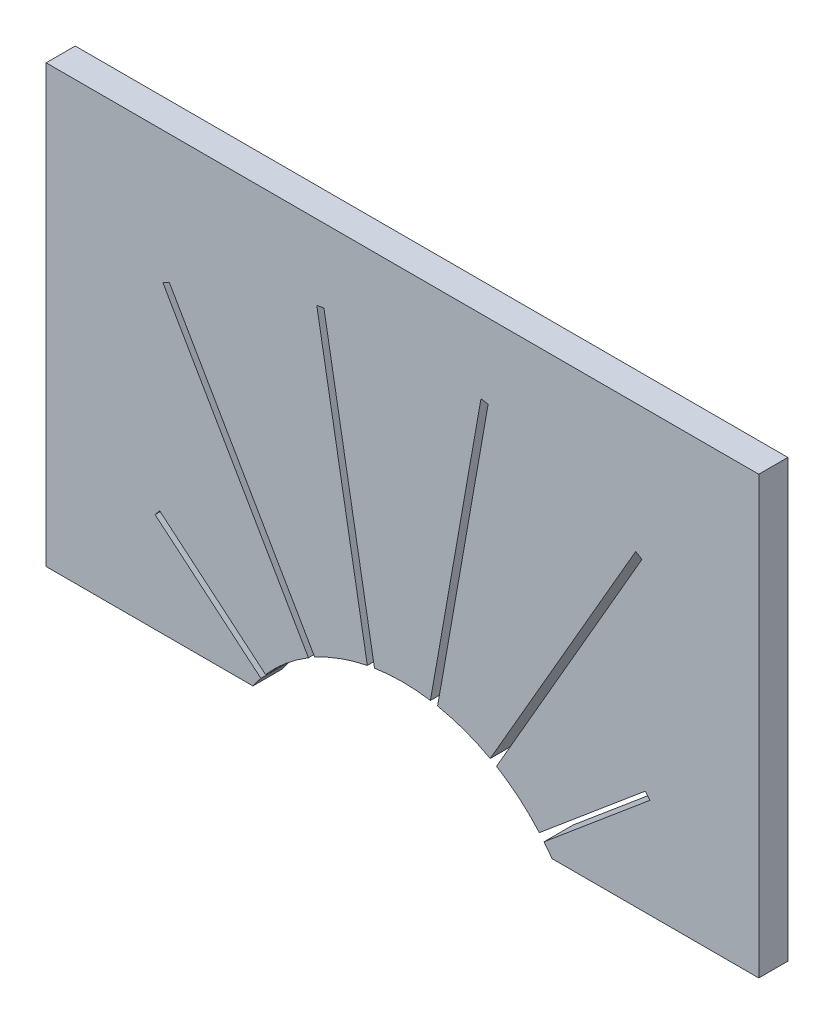
ISO-10303-21;
HEADER;
FILE_DESCRIPTION(('STEP AP214'),'2;1');
FILE_NAME('part.step','',(''),(''),'','','');
FILE_SCHEMA(('AUTOMOTIVE_DESIGN { 1 0 10303 214 1 1 1 1 }'));
ENDSEC;
DATA;
#1=APPLICATION_CONTEXT('core data for automotive mechanical design processes');
#2=APPLICATION_PROTOCOL_DEFINITION('international standard','automotive_design',2000,#1);
#3=PRODUCT_CONTEXT('',#1,'mechanical');
#4=PRODUCT('Part','Part','',(#3));
#5=PRODUCT_RELATED_PRODUCT_CATEGORY('part','',(#4));
#6=PRODUCT_DEFINITION_FORMATION('','',#4);
#7=PRODUCT_DEFINITION_CONTEXT('part definition',#1,'design');
#8=PRODUCT_DEFINITION('design','',#6,#7);
#9=PRODUCT_DEFINITION_SHAPE('','',#8);
#10=(LENGTH_UNIT() NAMED_UNIT(*) SI_UNIT(.MILLI.,.METRE.));
#11=(NAMED_UNIT(*) PLANE_ANGLE_UNIT() SI_UNIT($,.RADIAN.));
#12=(NAMED_UNIT(*) SI_UNIT($,.STERADIAN.) SOLID_ANGLE_UNIT());
#13=UNCERTAINTY_MEASURE_WITH_UNIT(LENGTH_MEASURE(1.E-05),#10,'distance_accuracy_value','');
#14=(GEOMETRIC_REPRESENTATION_CONTEXT(3) GLOBAL_UNCERTAINTY_ASSIGNED_CONTEXT((#13)) GLOBAL_UNIT_ASSIGNED_CONTEXT((#10,
#11,#12)) REPRESENTATION_CONTEXT('',''));
#15=CARTESIAN_POINT('',(0.,0.,0.));
#16=DIRECTION('',(0.,0.,1.));
#17=DIRECTION('',(1.,0.,0.));
#18=AXIS2_PLACEMENT_3D('',#15,#16,#17);
#19=CARTESIAN_POINT('',(-24.5,-15.,1.));
#20=DIRECTION('',(0.,1.,0.));
#21=DIRECTION('',(0.,0.,1.));
#22=AXIS2_PLACEMENT_3D('',#19,#20,#21);
#23=PLANE('',#22);
#24=DIRECTION('',(1.,0.,0.));
#25=VECTOR('',#24,1.);
#26=CARTESIAN_POINT('',(-24.5,-15.,-1.));
#27=LINE('',#26,#25);
#28=CARTESIAN_POINT('',(-24.5,-15.,-1.));
#29=VERTEX_POINT('',#28);
#30=CARTESIAN_POINT('',(-10.27956497134,-15.,-1.));
#31=VERTEX_POINT('',#30);
#32=EDGE_CURVE('E255',#29,#31,#27,.T.);
#33=ORIENTED_EDGE('',*,*,#32,.T.);
#34=DIRECTION('',(0.,0.,1.));
#35=VECTOR('',#34,1.);
#36=CARTESIAN_POINT('',(-10.27956497134,-15.,-9.));
#37=LINE('',#36,#35);
#38=CARTESIAN_POINT('',(-10.27956497134,-15.,1.));
#39=VERTEX_POINT('',#38);
#40=EDGE_CURVE('E240',#31,#39,#37,.T.);
#41=ORIENTED_EDGE('',*,*,#40,.T.);
#42=DIRECTION('',(1.,0.,0.));
#43=VECTOR('',#42,1.);
#44=CARTESIAN_POINT('',(-24.5,-15.,1.));
#45=LINE('',#44,#43);
#46=CARTESIAN_POINT('',(-24.5,-15.,1.));
#47=VERTEX_POINT('',#46);
#48=EDGE_CURVE('E253',#47,#39,#45,.T.);
#49=ORIENTED_EDGE('',*,*,#48,.F.);
#50=DIRECTION('',(0.,0.,-1.));
#51=VECTOR('',#50,1.);
#52=CARTESIAN_POINT('',(-24.5,-15.,1.));
#53=LINE('',#52,#51);
#54=EDGE_CURVE('E265',#47,#29,#53,.T.);
#55=ORIENTED_EDGE('',*,*,#54,.T.);
#56=EDGE_LOOP('',(#33,#41,#49,#55));
#57=FACE_BOUND('',#56,.T.);
#58=ADVANCED_FACE('F31',(#57),#23,.F.);
#59=CARTESIAN_POINT('',(24.5,-15.,1.));
#60=DIRECTION('',(-1.,0.,0.));
#61=DIRECTION('',(0.,0.,1.));
#62=AXIS2_PLACEMENT_3D('',#59,#60,#61);
#63=PLANE('',#62);
#64=DIRECTION('',(0.,1.,0.));
#65=VECTOR('',#64,1.);
#66=CARTESIAN_POINT('',(24.5,-15.,-1.));
#67=LINE('',#66,#65);
#68=CARTESIAN_POINT('',(24.5,-15.,-1.));
#69=VERTEX_POINT('',#68);
#70=CARTESIAN_POINT('',(24.5,15.,-1.));
#71=VERTEX_POINT('',#70);
#72=EDGE_CURVE('E270',#69,#71,#67,.T.);
#73=ORIENTED_EDGE('',*,*,#72,.T.);
#74=DIRECTION('',(0.,0.,-1.));
#75=VECTOR('',#74,1.);
#76=CARTESIAN_POINT('',(24.5,15.,1.));
#77=LINE('',#76,#75);
#78=CARTESIAN_POINT('',(24.5,15.,1.));
#79=VERTEX_POINT('',#78);
#80=EDGE_CURVE('E283',#79,#71,#77,.T.);
#81=ORIENTED_EDGE('',*,*,#80,.F.);
#82=DIRECTION('',(0.,1.,0.));
#83=VECTOR('',#82,1.);
#84=CARTESIAN_POINT('',(24.5,-15.,1.));
#85=LINE('',#84,#83);
#86=CARTESIAN_POINT('',(24.5,-15.,1.));
#87=VERTEX_POINT('',#86);
#88=EDGE_CURVE('E277',#87,#79,#85,.T.);
#89=ORIENTED_EDGE('',*,*,#88,.F.);
#90=DIRECTION('',(0.,0.,-1.));
#91=VECTOR('',#90,1.);
#92=CARTESIAN_POINT('',(24.5,-15.,1.));
#93=LINE('',#92,#91);
#94=EDGE_CURVE('E263',#87,#69,#93,.T.);
#95=ORIENTED_EDGE('',*,*,#94,.T.);
#96=EDGE_LOOP('',(#73,#81,#89,#95));
#97=FACE_BOUND('',#96,.T.);
#98=ADVANCED_FACE('F33',(#97),#63,.F.);
#99=CARTESIAN_POINT('',(-24.5,15.,1.));
#100=DIRECTION('',(0.,-1.,0.));
#101=DIRECTION('',(0.,0.,-1.));
#102=AXIS2_PLACEMENT_3D('',#99,#100,#101);
#103=PLANE('',#102);
#104=DIRECTION('',(-1.,0.,0.));
#105=VECTOR('',#104,1.);
#106=CARTESIAN_POINT('',(-24.5,15.,-1.));
#107=LINE('',#106,#105);
#108=CARTESIAN_POINT('',(-24.5,15.,-1.));
#109=VERTEX_POINT('',#108);
#110=EDGE_CURVE('E273',#71,#109,#107,.T.);
#111=ORIENTED_EDGE('',*,*,#110,.T.);
#112=DIRECTION('',(0.,0.,-1.));
#113=VECTOR('',#112,1.);
#114=CARTESIAN_POINT('',(-24.5,15.,1.));
#115=LINE('',#114,#113);
#116=CARTESIAN_POINT('',(-24.5,15.,1.));
#117=VERTEX_POINT('',#116);
#118=EDGE_CURVE('E280',#117,#109,#115,.T.);
#119=ORIENTED_EDGE('',*,*,#118,.F.);
#120=DIRECTION('',(-1.,0.,0.));
#121=VECTOR('',#120,1.);
#122=CARTESIAN_POINT('',(-24.5,15.,1.));
#123=LINE('',#122,#121);
#124=EDGE_CURVE('E85',#79,#117,#123,.T.);
#125=ORIENTED_EDGE('',*,*,#124,.F.);
#126=ORIENTED_EDGE('',*,*,#80,.T.);
#127=EDGE_LOOP('',(#111,#119,#125,#126));
#128=FACE_BOUND('',#127,.T.);
#129=ADVANCED_FACE('F406',(#128),#103,.F.);
#130=CARTESIAN_POINT('',(-24.5,-15.,1.));
#131=DIRECTION('',(1.,0.,0.));
#132=DIRECTION('',(0.,0.,-1.));
#133=AXIS2_PLACEMENT_3D('',#130,#131,#132);
#134=PLANE('',#133);
#135=DIRECTION('',(0.,-1.,0.));
#136=VECTOR('',#135,1.);
#137=CARTESIAN_POINT('',(-24.5,-15.,-1.));
#138=LINE('',#137,#136);
#139=EDGE_CURVE('E275',#109,#29,#138,.T.);
#140=ORIENTED_EDGE('',*,*,#139,.T.);
#141=ORIENTED_EDGE('',*,*,#54,.F.);
#142=DIRECTION('',(0.,-1.,0.));
#143=VECTOR('',#142,1.);
#144=CARTESIAN_POINT('',(-24.5,-15.,1.));
#145=LINE('',#144,#143);
#146=EDGE_CURVE('E261',#117,#47,#145,.T.);
#147=ORIENTED_EDGE('',*,*,#146,.F.);
#148=ORIENTED_EDGE('',*,*,#118,.T.);
#149=EDGE_LOOP('',(#140,#141,#147,#148));
#150=FACE_BOUND('',#149,.T.);
#151=ADVANCED_FACE('F409',(#150),#134,.F.);
#152=CARTESIAN_POINT('',(10.27956497134,-15.,1.));
#153=VERTEX_POINT('',#152);
#154=EDGE_CURVE('E55',#153,#87,#45,.T.);
#155=ORIENTED_EDGE('',*,*,#154,.F.);
#156=DIRECTION('',(0.,0.,1.));
#157=VECTOR('',#156,1.);
#158=CARTESIAN_POINT('',(10.27956497134,-15.,-9.));
#159=LINE('',#158,#157);
#160=CARTESIAN_POINT('',(10.27956497134,-15.,-1.));
#161=VERTEX_POINT('',#160);
#162=EDGE_CURVE('E256',#161,#153,#159,.T.);
#163=ORIENTED_EDGE('',*,*,#162,.F.);
#164=EDGE_CURVE('E77',#161,#69,#27,.T.);
#165=ORIENTED_EDGE('',*,*,#164,.T.);
#166=ORIENTED_EDGE('',*,*,#94,.F.);
#167=EDGE_LOOP('',(#155,#163,#165,#166));
#168=FACE_BOUND('',#167,.T.);
#169=ADVANCED_FACE('F412',(#168),#23,.F.);
#170=CARTESIAN_POINT('',(24.5,15.,1.));
#171=DIRECTION('',(0.,0.,-1.));
#172=DIRECTION('',(-1.,0.,0.));
#173=AXIS2_PLACEMENT_3D('',#170,#171,#172);
#174=PLANE('',#173);
#175=ORIENTED_EDGE('',*,*,#48,.T.);
#176=CARTESIAN_POINT('',(0.,-22.112,1.));
#177=DIRECTION('',(0.,0.,1.));
#178=DIRECTION('',(1.,0.,0.));
#179=AXIS2_PLACEMENT_3D('',#176,#177,#178);
#180=CIRCLE('',#179,12.5);
#181=CARTESIAN_POINT('',(-9.73433713875166,-14.2702731194513,1.));
#182=VERTEX_POINT('',#181);
#183=EDGE_CURVE('E237',#182,#39,#180,.T.);
#184=ORIENTED_EDGE('',*,*,#183,.F.);
#185=DIRECTION('',(0.766044443118979,-0.642787609686538,0.));
#186=VECTOR('',#185,1.);
#187=CARTESIAN_POINT('',(-9.73433713875166,-14.2702731194513,1.));
#188=LINE('',#187,#186);
#189=CARTESIAN_POINT('',(-17.0136746510392,-8.16218369767592,1.));
#190=VERTEX_POINT('',#189);
#191=EDGE_CURVE('E257',#190,#182,#188,.T.);
#192=ORIENTED_EDGE('',*,*,#191,.F.);
#193=DIRECTION('',(-0.642787609686541,-0.766044443118977,0.));
#194=VECTOR('',#193,1.);
#195=CARTESIAN_POINT('',(-17.0136746510392,-8.16218369767592,1.));
#196=LINE('',#195,#194);
#197=CARTESIAN_POINT('',(-16.6922808461959,-7.77916147611643,1.));
#198=VERTEX_POINT('',#197);
#199=EDGE_CURVE('E342',#198,#190,#196,.T.);
#200=ORIENTED_EDGE('',*,*,#199,.F.);
#201=DIRECTION('',(-0.76604444311898,0.642787609686538,0.));
#202=VECTOR('',#201,1.);
#203=CARTESIAN_POINT('',(-9.41294333390839,-13.8872508978918,1.));
#204=LINE('',#203,#202);
#205=CARTESIAN_POINT('',(-9.41294333390839,-13.8872508978918,1.));
#206=VERTEX_POINT('',#205);
#207=EDGE_CURVE('E775',#206,#198,#204,.T.);
#208=ORIENTED_EDGE('',*,*,#207,.F.);
#209=CARTESIAN_POINT('',(0.,-22.112,1.));
#210=DIRECTION('',(0.,0.,1.));
#211=DIRECTION('',(1.,0.,0.));
#212=AXIS2_PLACEMENT_3D('',#209,#210,#211);
#213=CIRCLE('',#212,12.5);
#214=CARTESIAN_POINT('',(-6.46525622592112,-11.4138477327537,1.));
#215=VERTEX_POINT('',#214);
#216=EDGE_CURVE('E359',#215,#206,#213,.T.);
#217=ORIENTED_EDGE('',*,*,#216,.F.);
#218=DIRECTION('',(0.500000000000001,-0.866025403784438,0.));
#219=VECTOR('',#218,1.);
#220=CARTESIAN_POINT('',(-6.46525622592112,-11.4138477327537,1.));
#221=LINE('',#220,#219);
#222=CARTESIAN_POINT('',(-16.4710257224933,5.91665340413209,1.));
#223=VERTEX_POINT('',#222);
#224=EDGE_CURVE('E771',#223,#215,#221,.T.);
#225=ORIENTED_EDGE('',*,*,#224,.F.);
#226=CARTESIAN_POINT('',(0.,-22.112,1.));
#227=DIRECTION('',(0.,0.,1.));
#228=DIRECTION('',(1.,0.,0.));
#229=AXIS2_PLACEMENT_3D('',#226,#227,#228);
#230=CIRCLE('',#229,32.51);
#231=CARTESIAN_POINT('',(-16.038013020601,6.16665340413209,1.));
#232=VERTEX_POINT('',#231);
#233=EDGE_CURVE('E768',#232,#223,#230,.T.);
#234=ORIENTED_EDGE('',*,*,#233,.F.);
#235=DIRECTION('',(-0.500000000000001,0.866025403784438,0.));
#236=VECTOR('',#235,1.);
#237=CARTESIAN_POINT('',(-6.0322435240289,-11.1638477327537,1.));
#238=LINE('',#237,#236);
#239=CARTESIAN_POINT('',(-6.0322435240289,-11.1638477327537,1.));
#240=VERTEX_POINT('',#239);
#241=EDGE_CURVE('E765',#240,#232,#238,.T.);
#242=ORIENTED_EDGE('',*,*,#241,.F.);
#243=CARTESIAN_POINT('',(0.,-22.112,1.));
#244=DIRECTION('',(0.,0.,1.));
#245=DIRECTION('',(1.,0.,0.));
#246=AXIS2_PLACEMENT_3D('',#243,#244,#245);
#247=CIRCLE('',#246,12.5);
#248=CARTESIAN_POINT('',(-2.4163699952248,-9.84777739739785,1.));
#249=VERTEX_POINT('',#248);
#250=EDGE_CURVE('E762',#249,#240,#247,.T.);
#251=ORIENTED_EDGE('',*,*,#250,.F.);
#252=DIRECTION('',(0.173648177666931,-0.984807753012208,0.));
#253=VECTOR('',#252,1.);
#254=CARTESIAN_POINT('',(-2.4163699952248,-9.84777739739786,1.));
#255=LINE('',#254,#253);
#256=CARTESIAN_POINT('',(-5.89133727369503,9.85974135275668,1.));
#257=VERTEX_POINT('',#256);
#258=EDGE_CURVE('E759',#257,#249,#255,.T.);
#259=ORIENTED_EDGE('',*,*,#258,.F.);
#260=CARTESIAN_POINT('',(0.,-22.112,1.));
#261=DIRECTION('',(0.,0.,1.));
#262=DIRECTION('',(1.,0.,0.));
#263=AXIS2_PLACEMENT_3D('',#260,#261,#262);
#264=CIRCLE('',#263,32.51);
#265=CARTESIAN_POINT('',(-5.39893339718892,9.94656544159014,1.));
#266=VERTEX_POINT('',#265);
#267=EDGE_CURVE('E756',#266,#257,#264,.T.);
#268=ORIENTED_EDGE('',*,*,#267,.F.);
#269=DIRECTION('',(-0.173648177666931,0.984807753012208,0.));
#270=VECTOR('',#269,1.);
#271=CARTESIAN_POINT('',(-1.92396611871869,-9.76095330856439,1.));
#272=LINE('',#271,#270);
#273=CARTESIAN_POINT('',(-1.92396611871869,-9.76095330856439,1.));
#274=VERTEX_POINT('',#273);
#275=EDGE_CURVE('E753',#274,#266,#272,.T.);
#276=ORIENTED_EDGE('',*,*,#275,.F.);
#277=CARTESIAN_POINT('',(0.,-22.112,1.));
#278=DIRECTION('',(0.,0.,1.));
#279=DIRECTION('',(1.,0.,0.));
#280=AXIS2_PLACEMENT_3D('',#277,#278,#279);
#281=CIRCLE('',#280,12.5);
#282=CARTESIAN_POINT('',(1.92396611871869,-9.76095330856439,1.));
#283=VERTEX_POINT('',#282);
#284=EDGE_CURVE('E750',#283,#274,#281,.T.);
#285=ORIENTED_EDGE('',*,*,#284,.F.);
#286=DIRECTION('',(-0.173648177666931,-0.984807753012208,0.));
#287=VECTOR('',#286,1.);
#288=CARTESIAN_POINT('',(1.92396611871869,-9.76095330856439,1.));
#289=LINE('',#288,#287);
#290=CARTESIAN_POINT('',(5.39893339718892,9.94656544159015,1.));
#291=VERTEX_POINT('',#290);
#292=EDGE_CURVE('E747',#291,#283,#289,.T.);
#293=ORIENTED_EDGE('',*,*,#292,.F.);
#294=CARTESIAN_POINT('',(0.,-22.112,1.));
#295=DIRECTION('',(0.,0.,1.));
#296=DIRECTION('',(1.,0.,0.));
#297=AXIS2_PLACEMENT_3D('',#294,#295,#296);
#298=CIRCLE('',#297,32.51);
#299=CARTESIAN_POINT('',(5.89133727369502,9.85974135275668,1.));
#300=VERTEX_POINT('',#299);
#301=EDGE_CURVE('E744',#300,#291,#298,.T.);
#302=ORIENTED_EDGE('',*,*,#301,.F.);
#303=DIRECTION('',(0.173648177666931,0.984807753012208,0.));
#304=VECTOR('',#303,1.);
#305=CARTESIAN_POINT('',(2.4163699952248,-9.84777739739786,1.));
#306=LINE('',#305,#304);
#307=CARTESIAN_POINT('',(2.4163699952248,-9.84777739739786,1.));
#308=VERTEX_POINT('',#307);
#309=EDGE_CURVE('E741',#308,#300,#306,.T.);
#310=ORIENTED_EDGE('',*,*,#309,.F.);
#311=CARTESIAN_POINT('',(0.,-22.112,1.));
#312=DIRECTION('',(0.,0.,1.));
#313=DIRECTION('',(1.,0.,0.));
#314=AXIS2_PLACEMENT_3D('',#311,#312,#313);
#315=CIRCLE('',#314,12.5);
#316=CARTESIAN_POINT('',(6.0322435240289,-11.1638477327537,1.));
#317=VERTEX_POINT('',#316);
#318=EDGE_CURVE('E738',#317,#308,#315,.T.);
#319=ORIENTED_EDGE('',*,*,#318,.F.);
#320=DIRECTION('',(-0.500000000000001,-0.866025403784438,0.));
#321=VECTOR('',#320,1.);
#322=CARTESIAN_POINT('',(6.0322435240289,-11.1638477327537,1.));
#323=LINE('',#322,#321);
#324=CARTESIAN_POINT('',(16.038013020601,6.16665340413209,1.));
#325=VERTEX_POINT('',#324);
#326=EDGE_CURVE('E735',#325,#317,#323,.T.);
#327=ORIENTED_EDGE('',*,*,#326,.F.);
#328=CARTESIAN_POINT('',(0.,-22.112,1.));
#329=DIRECTION('',(0.,0.,1.));
#330=DIRECTION('',(1.,0.,0.));
#331=AXIS2_PLACEMENT_3D('',#328,#329,#330);
#332=CIRCLE('',#331,32.51);
#333=CARTESIAN_POINT('',(16.4710257224933,5.91665340413209,1.));
#334=VERTEX_POINT('',#333);
#335=EDGE_CURVE('E732',#334,#325,#332,.T.);
#336=ORIENTED_EDGE('',*,*,#335,.F.);
#337=DIRECTION('',(0.500000000000001,0.866025403784438,0.));
#338=VECTOR('',#337,1.);
#339=CARTESIAN_POINT('',(6.46525622592112,-11.4138477327537,1.));
#340=LINE('',#339,#338);
#341=CARTESIAN_POINT('',(6.46525622592112,-11.4138477327537,1.));
#342=VERTEX_POINT('',#341);
#343=EDGE_CURVE('E729',#342,#334,#340,.T.);
#344=ORIENTED_EDGE('',*,*,#343,.F.);
#345=CARTESIAN_POINT('',(0.,-22.112,1.));
#346=DIRECTION('',(0.,0.,1.));
#347=DIRECTION('',(1.,0.,0.));
#348=AXIS2_PLACEMENT_3D('',#345,#346,#347);
#349=CIRCLE('',#348,12.5);
#350=CARTESIAN_POINT('',(9.41294333390839,-13.8872508978918,1.));
#351=VERTEX_POINT('',#350);
#352=EDGE_CURVE('E723',#351,#342,#349,.T.);
#353=ORIENTED_EDGE('',*,*,#352,.F.);
#354=DIRECTION('',(-0.766044443118979,-0.642787609686538,0.));
#355=VECTOR('',#354,1.);
#356=CARTESIAN_POINT('',(9.41294333390839,-13.8872508978918,1.));
#357=LINE('',#356,#355);
#358=CARTESIAN_POINT('',(16.6922808461959,-7.77916147611643,1.));
#359=VERTEX_POINT('',#358);
#360=EDGE_CURVE('E721',#359,#351,#357,.T.);
#361=ORIENTED_EDGE('',*,*,#360,.F.);
#362=DIRECTION('',(-0.642787609686538,0.766044443118979,0.));
#363=VECTOR('',#362,1.);
#364=CARTESIAN_POINT('',(17.0136746510392,-8.16218369767592,1.));
#365=LINE('',#364,#363);
#366=CARTESIAN_POINT('',(17.0136746510392,-8.16218369767592,1.));
#367=VERTEX_POINT('',#366);
#368=EDGE_CURVE('E716',#367,#359,#365,.T.);
#369=ORIENTED_EDGE('',*,*,#368,.F.);
#370=DIRECTION('',(0.766044443118979,0.642787609686538,0.));
#371=VECTOR('',#370,1.);
#372=CARTESIAN_POINT('',(9.73433713875166,-14.2702731194513,1.));
#373=LINE('',#372,#371);
#374=CARTESIAN_POINT('',(9.73433713875166,-14.2702731194513,1.));
#375=VERTEX_POINT('',#374);
#376=EDGE_CURVE('E714',#375,#367,#373,.T.);
#377=ORIENTED_EDGE('',*,*,#376,.F.);
#378=CARTESIAN_POINT('',(0.,-22.112,1.));
#379=DIRECTION('',(0.,0.,1.));
#380=DIRECTION('',(1.,0.,0.));
#381=AXIS2_PLACEMENT_3D('',#378,#379,#380);
#382=CIRCLE('',#381,12.5);
#383=EDGE_CURVE('E247',#153,#375,#382,.T.);
#384=ORIENTED_EDGE('',*,*,#383,.F.);
#385=ORIENTED_EDGE('',*,*,#154,.T.);
#386=ORIENTED_EDGE('',*,*,#88,.T.);
#387=ORIENTED_EDGE('',*,*,#124,.T.);
#388=ORIENTED_EDGE('',*,*,#146,.T.);
#389=EDGE_LOOP('',(#175,#184,#192,#200,#208,#217,#225,#234,#242,#251,#259,#268,#276,#285,#293,
#302,#310,#319,#327,#336,#344,#353,#361,#369,#377,#384,#385,#386,#387,#388));
#390=FACE_BOUND('',#389,.T.);
#391=ADVANCED_FACE('F259',(#390),#174,.F.);
#392=CARTESIAN_POINT('',(24.5,15.,-1.));
#393=DIRECTION('',(0.,0.,-1.));
#394=DIRECTION('',(-1.,0.,0.));
#395=AXIS2_PLACEMENT_3D('',#392,#393,#394);
#396=PLANE('',#395);
#397=CARTESIAN_POINT('',(0.,-22.112,-1.));
#398=DIRECTION('',(0.,0.,-1.));
#399=DIRECTION('',(-1.,0.,0.));
#400=AXIS2_PLACEMENT_3D('',#397,#398,#399);
#401=CIRCLE('',#400,12.5);
#402=CARTESIAN_POINT('',(-9.73433713875166,-14.2702731194513,-1.));
#403=VERTEX_POINT('',#402);
#404=EDGE_CURVE('E11',#31,#403,#401,.T.);
#405=ORIENTED_EDGE('',*,*,#404,.F.);
#406=ORIENTED_EDGE('',*,*,#32,.F.);
#407=ORIENTED_EDGE('',*,*,#139,.F.);
#408=ORIENTED_EDGE('',*,*,#110,.F.);
#409=ORIENTED_EDGE('',*,*,#72,.F.);
#410=ORIENTED_EDGE('',*,*,#164,.F.);
#411=CARTESIAN_POINT('',(0.,-22.112,-1.));
#412=DIRECTION('',(0.,0.,-1.));
#413=DIRECTION('',(-1.,0.,0.));
#414=AXIS2_PLACEMENT_3D('',#411,#412,#413);
#415=CIRCLE('',#414,12.5);
#416=CARTESIAN_POINT('',(9.73433713875166,-14.2702731194513,-1.));
#417=VERTEX_POINT('',#416);
#418=EDGE_CURVE('E285',#417,#161,#415,.T.);
#419=ORIENTED_EDGE('',*,*,#418,.F.);
#420=DIRECTION('',(-0.766044443118979,-0.642787609686538,0.));
#421=VECTOR('',#420,1.);
#422=CARTESIAN_POINT('',(32.8119797437361,5.09416827883215,-1.));
#423=LINE('',#422,#421);
#424=CARTESIAN_POINT('',(17.0136746510392,-8.16218369767592,-1.));
#425=VERTEX_POINT('',#424);
#426=EDGE_CURVE('E287',#425,#417,#423,.T.);
#427=ORIENTED_EDGE('',*,*,#426,.F.);
#428=DIRECTION('',(0.642787609686538,-0.766044443118979,0.));
#429=VECTOR('',#428,1.);
#430=CARTESIAN_POINT('',(8.70169490730308,1.7436480234919,-1.));
#431=LINE('',#430,#429);
#432=CARTESIAN_POINT('',(16.6922808461959,-7.77916147611643,-1.));
#433=VERTEX_POINT('',#432);
#434=EDGE_CURVE('E289',#433,#425,#431,.T.);
#435=ORIENTED_EDGE('',*,*,#434,.F.);
#436=DIRECTION('',(0.766044443118979,0.642787609686538,0.));
#437=VECTOR('',#436,1.);
#438=CARTESIAN_POINT('',(32.4905859388928,5.47719050039165,-1.));
#439=LINE('',#438,#437);
#440=CARTESIAN_POINT('',(9.41294333390839,-13.8872508978918,-1.));
#441=VERTEX_POINT('',#440);
#442=EDGE_CURVE('E291',#441,#433,#439,.T.);
#443=ORIENTED_EDGE('',*,*,#442,.F.);
#444=CARTESIAN_POINT('',(0.,-22.112,-1.));
#445=DIRECTION('',(0.,0.,-1.));
#446=DIRECTION('',(-1.,0.,0.));
#447=AXIS2_PLACEMENT_3D('',#444,#445,#446);
#448=CIRCLE('',#447,12.5);
#449=CARTESIAN_POINT('',(6.46525622592112,-11.4138477327537,-1.));
#450=VERTEX_POINT('',#449);
#451=EDGE_CURVE('E293',#450,#441,#448,.T.);
#452=ORIENTED_EDGE('',*,*,#451,.F.);
#453=DIRECTION('',(-0.500000000000001,-0.866025403784438,0.));
#454=VECTOR('',#453,1.);
#455=CARTESIAN_POINT('',(22.4114737435702,16.2058111963593,-1.));
#456=LINE('',#455,#454);
#457=CARTESIAN_POINT('',(16.4710257224933,5.91665340413209,-1.));
#458=VERTEX_POINT('',#457);
#459=EDGE_CURVE('E295',#458,#450,#456,.T.);
#460=ORIENTED_EDGE('',*,*,#459,.F.);
#461=CARTESIAN_POINT('',(0.,-22.112,-1.));
#462=DIRECTION('',(0.,0.,-1.));
#463=DIRECTION('',(-1.,0.,0.));
#464=AXIS2_PLACEMENT_3D('',#461,#462,#463);
#465=CIRCLE('',#464,32.51);
#466=CARTESIAN_POINT('',(16.038013020601,6.16665340413209,-1.));
#467=VERTEX_POINT('',#466);
#468=EDGE_CURVE('E297',#467,#458,#465,.T.);
#469=ORIENTED_EDGE('',*,*,#468,.F.);
#470=DIRECTION('',(0.500000000000001,0.866025403784438,0.));
#471=VECTOR('',#470,1.);
#472=CARTESIAN_POINT('',(21.978461041678,16.4558111963593,-1.));
#473=LINE('',#472,#471);
#474=CARTESIAN_POINT('',(6.0322435240289,-11.1638477327537,-1.));
#475=VERTEX_POINT('',#474);
#476=EDGE_CURVE('E299',#475,#467,#473,.T.);
#477=ORIENTED_EDGE('',*,*,#476,.F.);
#478=CARTESIAN_POINT('',(0.,-22.112,-1.));
#479=DIRECTION('',(0.,0.,-1.));
#480=DIRECTION('',(-1.,0.,0.));
#481=AXIS2_PLACEMENT_3D('',#478,#479,#480);
#482=CIRCLE('',#481,12.5);
#483=CARTESIAN_POINT('',(2.4163699952248,-9.84777739739786,-1.));
#484=VERTEX_POINT('',#483);
#485=EDGE_CURVE('E301',#484,#475,#482,.T.);
#486=ORIENTED_EDGE('',*,*,#485,.F.);
#487=DIRECTION('',(-0.173648177666931,-0.984807753012208,0.));
#488=VECTOR('',#487,1.);
#489=CARTESIAN_POINT('',(7.33149311317682,18.027270982626,-1.));
#490=LINE('',#489,#488);
#491=CARTESIAN_POINT('',(5.89133727369502,9.85974135275668,-1.));
#492=VERTEX_POINT('',#491);
#493=EDGE_CURVE('E303',#492,#484,#490,.T.);
#494=ORIENTED_EDGE('',*,*,#493,.F.);
#495=CARTESIAN_POINT('',(0.,-22.112,-1.));
#496=DIRECTION('',(0.,0.,-1.));
#497=DIRECTION('',(-1.,0.,0.));
#498=AXIS2_PLACEMENT_3D('',#495,#496,#497);
#499=CIRCLE('',#498,32.51);
#500=CARTESIAN_POINT('',(5.39893339718892,9.94656544159015,-1.));
#501=VERTEX_POINT('',#500);
#502=EDGE_CURVE('E305',#501,#492,#499,.T.);
#503=ORIENTED_EDGE('',*,*,#502,.F.);
#504=DIRECTION('',(0.173648177666931,0.984807753012208,0.));
#505=VECTOR('',#504,1.);
#506=CARTESIAN_POINT('',(6.83908923667072,18.1140950714595,-1.));
#507=LINE('',#506,#505);
#508=CARTESIAN_POINT('',(1.92396611871869,-9.76095330856439,-1.));
#509=VERTEX_POINT('',#508);
#510=EDGE_CURVE('E307',#509,#501,#507,.T.);
#511=ORIENTED_EDGE('',*,*,#510,.F.);
#512=CARTESIAN_POINT('',(0.,-22.112,-1.));
#513=DIRECTION('',(0.,0.,-1.));
#514=DIRECTION('',(-1.,0.,0.));
#515=AXIS2_PLACEMENT_3D('',#512,#513,#514);
#516=CIRCLE('',#515,12.5);
#517=CARTESIAN_POINT('',(-1.92396611871869,-9.76095330856439,-1.));
#518=VERTEX_POINT('',#517);
#519=EDGE_CURVE('E309',#518,#509,#516,.T.);
#520=ORIENTED_EDGE('',*,*,#519,.F.);
#521=DIRECTION('',(0.173648177666931,-0.984807753012208,0.));
#522=VECTOR('',#521,1.);
#523=CARTESIAN_POINT('',(-5.36155844592546,9.73460155998058,-1.));
#524=LINE('',#523,#522);
#525=CARTESIAN_POINT('',(-5.39893339718892,9.94656544159014,-1.));
#526=VERTEX_POINT('',#525);
#527=EDGE_CURVE('E311',#526,#518,#524,.T.);
#528=ORIENTED_EDGE('',*,*,#527,.F.);
#529=CARTESIAN_POINT('',(0.,-22.112,-1.));
#530=DIRECTION('',(0.,0.,-1.));
#531=DIRECTION('',(-1.,0.,0.));
#532=AXIS2_PLACEMENT_3D('',#529,#530,#531);
#533=CIRCLE('',#532,32.51);
#534=CARTESIAN_POINT('',(-5.89133727369503,9.85974135275668,-1.));
#535=VERTEX_POINT('',#534);
#536=EDGE_CURVE('E313',#535,#526,#533,.T.);
#537=ORIENTED_EDGE('',*,*,#536,.F.);
#538=DIRECTION('',(-0.173648177666931,0.984807753012208,0.));
#539=VECTOR('',#538,1.);
#540=CARTESIAN_POINT('',(-5.85396232243157,9.64777747114711,-1.));
#541=LINE('',#540,#539);
#542=CARTESIAN_POINT('',(-2.4163699952248,-9.84777739739785,-1.));
#543=VERTEX_POINT('',#542);
#544=EDGE_CURVE('E315',#543,#535,#541,.T.);
#545=ORIENTED_EDGE('',*,*,#544,.F.);
#546=CARTESIAN_POINT('',(0.,-22.112,-1.));
#547=DIRECTION('',(0.,0.,-1.));
#548=DIRECTION('',(-1.,0.,0.));
#549=AXIS2_PLACEMENT_3D('',#546,#547,#548);
#550=CIRCLE('',#549,12.5);
#551=CARTESIAN_POINT('',(-6.0322435240289,-11.1638477327537,-1.));
#552=VERTEX_POINT('',#551);
#553=EDGE_CURVE('E317',#552,#543,#550,.T.);
#554=ORIENTED_EDGE('',*,*,#553,.F.);
#555=DIRECTION('',(0.500000000000001,-0.866025403784438,0.));
#556=VECTOR('',#555,1.);
#557=CARTESIAN_POINT('',(-9.72846104167793,-4.76181119635944,-1.));
#558=LINE('',#557,#556);
#559=CARTESIAN_POINT('',(-16.038013020601,6.16665340413209,-1.));
#560=VERTEX_POINT('',#559);
#561=EDGE_CURVE('E319',#560,#552,#558,.T.);
#562=ORIENTED_EDGE('',*,*,#561,.F.);
#563=CARTESIAN_POINT('',(0.,-22.112,-1.));
#564=DIRECTION('',(0.,0.,-1.));
#565=DIRECTION('',(-1.,0.,0.));
#566=AXIS2_PLACEMENT_3D('',#563,#564,#565);
#567=CIRCLE('',#566,32.51);
#568=CARTESIAN_POINT('',(-16.4710257224933,5.91665340413209,-1.));
#569=VERTEX_POINT('',#568);
#570=EDGE_CURVE('E321',#569,#560,#567,.T.);
#571=ORIENTED_EDGE('',*,*,#570,.F.);
#572=DIRECTION('',(-0.500000000000001,0.866025403784438,0.));
#573=VECTOR('',#572,1.);
#574=CARTESIAN_POINT('',(-10.1614737435702,-5.01181119635944,-1.));
#575=LINE('',#574,#573);
#576=CARTESIAN_POINT('',(-6.46525622592112,-11.4138477327537,-1.));
#577=VERTEX_POINT('',#576);
#578=EDGE_CURVE('E323',#577,#569,#575,.T.);
#579=ORIENTED_EDGE('',*,*,#578,.F.);
#580=CARTESIAN_POINT('',(0.,-22.112,-1.));
#581=DIRECTION('',(0.,0.,-1.));
#582=DIRECTION('',(-1.,0.,0.));
#583=AXIS2_PLACEMENT_3D('',#580,#581,#582);
#584=CIRCLE('',#583,12.5);
#585=CARTESIAN_POINT('',(-9.41294333390839,-13.8872508978918,-1.));
#586=VERTEX_POINT('',#585);
#587=EDGE_CURVE('E325',#586,#577,#584,.T.);
#588=ORIENTED_EDGE('',*,*,#587,.F.);
#589=DIRECTION('',(0.76604444311898,-0.642787609686538,0.));
#590=VECTOR('',#589,1.);
#591=CARTESIAN_POINT('',(-3.73620558605294,-18.6505994484074,-1.));
#592=LINE('',#591,#590);
#593=CARTESIAN_POINT('',(-16.6922808461959,-7.77916147611643,-1.));
#594=VERTEX_POINT('',#593);
#595=EDGE_CURVE('E327',#594,#586,#592,.T.);
#596=ORIENTED_EDGE('',*,*,#595,.F.);
#597=DIRECTION('',(0.642787609686541,0.766044443118977,0.));
#598=VECTOR('',#597,1.);
#599=CARTESIAN_POINT('',(11.5439247398572,25.8714379722909,-1.));
#600=LINE('',#599,#598);
#601=CARTESIAN_POINT('',(-17.0136746510392,-8.16218369767592,-1.));
#602=VERTEX_POINT('',#601);
#603=EDGE_CURVE('E329',#602,#594,#600,.T.);
#604=ORIENTED_EDGE('',*,*,#603,.F.);
#605=DIRECTION('',(-0.766044443118979,0.642787609686538,0.));
#606=VECTOR('',#605,1.);
#607=CARTESIAN_POINT('',(-4.05759939089621,-19.0336216699669,-1.));
#608=LINE('',#607,#606);
#609=EDGE_CURVE('E39',#403,#602,#608,.T.);
#610=ORIENTED_EDGE('',*,*,#609,.F.);
#611=EDGE_LOOP('',(#405,#406,#407,#408,#409,#410,#419,#427,#435,#443,#452,#460,#469,#477,#486,
#494,#503,#511,#520,#528,#537,#545,#554,#562,#571,#579,#588,#596,#604,#610));
#612=FACE_BOUND('',#611,.T.);
#613=ADVANCED_FACE('F346',(#612),#396,.T.);
#614=CARTESIAN_POINT('',(0.,-22.112,-9.));
#615=DIRECTION('',(0.,0.,1.));
#616=DIRECTION('',(1.,0.,0.));
#617=AXIS2_PLACEMENT_3D('',#614,#615,#616);
#618=CYLINDRICAL_SURFACE('',#617,12.5);
#619=ORIENTED_EDGE('',*,*,#404,.T.);
#620=DIRECTION('',(0.,0.,1.));
#621=VECTOR('',#620,1.);
#622=CARTESIAN_POINT('',(-9.73433713875166,-14.2702731194513,-9.));
#623=LINE('',#622,#621);
#624=EDGE_CURVE('E243',#403,#182,#623,.T.);
#625=ORIENTED_EDGE('',*,*,#624,.T.);
#626=ORIENTED_EDGE('',*,*,#183,.T.);
#627=ORIENTED_EDGE('',*,*,#40,.F.);
#628=EDGE_LOOP('',(#619,#625,#626,#627));
#629=FACE_BOUND('',#628,.T.);
#630=ADVANCED_FACE('F239',(#629),#618,.F.);
#631=CARTESIAN_POINT('',(-9.73433713875166,-14.2702731194513,-9.));
#632=DIRECTION('',(-0.642787609686538,-0.766044443118979,0.));
#633=DIRECTION('',(0.766044443118979,-0.642787609686538,0.));
#634=AXIS2_PLACEMENT_3D('',#631,#632,#633);
#635=PLANE('',#634);
#636=ORIENTED_EDGE('',*,*,#609,.T.);
#637=DIRECTION('',(0.,0.,1.));
#638=VECTOR('',#637,1.);
#639=CARTESIAN_POINT('',(-17.0136746510392,-8.16218369767592,-9.));
#640=LINE('',#639,#638);
#641=EDGE_CURVE('E334',#602,#190,#640,.T.);
#642=ORIENTED_EDGE('',*,*,#641,.T.);
#643=ORIENTED_EDGE('',*,*,#191,.T.);
#644=ORIENTED_EDGE('',*,*,#624,.F.);
#645=EDGE_LOOP('',(#636,#642,#643,#644));
#646=FACE_BOUND('',#645,.T.);
#647=ADVANCED_FACE('F333',(#646),#635,.F.);
#648=CARTESIAN_POINT('',(-17.0136746510392,-8.16218369767592,-9.));
#649=DIRECTION('',(-0.766044443118977,0.642787609686541,0.));
#650=DIRECTION('',(-0.642787609686541,-0.766044443118977,0.));
#651=AXIS2_PLACEMENT_3D('',#648,#649,#650);
#652=PLANE('',#651);
#653=ORIENTED_EDGE('',*,*,#603,.T.);
#654=DIRECTION('',(0.,0.,1.));
#655=VECTOR('',#654,1.);
#656=CARTESIAN_POINT('',(-16.6922808461959,-7.77916147611643,-9.));
#657=LINE('',#656,#655);
#658=EDGE_CURVE('E343',#594,#198,#657,.T.);
#659=ORIENTED_EDGE('',*,*,#658,.T.);
#660=ORIENTED_EDGE('',*,*,#199,.T.);
#661=ORIENTED_EDGE('',*,*,#641,.F.);
#662=EDGE_LOOP('',(#653,#659,#660,#661));
#663=FACE_BOUND('',#662,.T.);
#664=ADVANCED_FACE('F339',(#663),#652,.F.);
#665=CARTESIAN_POINT('',(-9.41294333390839,-13.8872508978918,-9.));
#666=DIRECTION('',(0.642787609686538,0.76604444311898,0.));
#667=DIRECTION('',(-0.76604444311898,0.642787609686538,0.));
#668=AXIS2_PLACEMENT_3D('',#665,#666,#667);
#669=PLANE('',#668);
#670=ORIENTED_EDGE('',*,*,#595,.T.);
#671=DIRECTION('',(0.,0.,1.));
#672=VECTOR('',#671,1.);
#673=CARTESIAN_POINT('',(-9.41294333390839,-13.8872508978918,-9.));
#674=LINE('',#673,#672);
#675=EDGE_CURVE('E353',#586,#206,#674,.T.);
#676=ORIENTED_EDGE('',*,*,#675,.T.);
#677=ORIENTED_EDGE('',*,*,#207,.T.);
#678=ORIENTED_EDGE('',*,*,#658,.F.);
#679=EDGE_LOOP('',(#670,#676,#677,#678));
#680=FACE_BOUND('',#679,.T.);
#681=ADVANCED_FACE('F351',(#680),#669,.F.);
#682=CARTESIAN_POINT('',(0.,-22.112,-9.));
#683=DIRECTION('',(0.,0.,1.));
#684=DIRECTION('',(1.,0.,0.));
#685=AXIS2_PLACEMENT_3D('',#682,#683,#684);
#686=CYLINDRICAL_SURFACE('',#685,12.5);
#687=ORIENTED_EDGE('',*,*,#587,.T.);
#688=DIRECTION('',(0.,0.,1.));
#689=VECTOR('',#688,1.);
#690=CARTESIAN_POINT('',(-6.46525622592112,-11.4138477327537,-9.));
#691=LINE('',#690,#689);
#692=EDGE_CURVE('E361',#577,#215,#691,.T.);
#693=ORIENTED_EDGE('',*,*,#692,.T.);
#694=ORIENTED_EDGE('',*,*,#216,.T.);
#695=ORIENTED_EDGE('',*,*,#675,.F.);
#696=EDGE_LOOP('',(#687,#693,#694,#695));
#697=FACE_BOUND('',#696,.T.);
#698=ADVANCED_FACE('F356',(#697),#686,.F.);
#699=CARTESIAN_POINT('',(-6.46525622592112,-11.4138477327537,-9.));
#700=DIRECTION('',(-0.866025403784438,-0.500000000000001,0.));
#701=DIRECTION('',(0.500000000000001,-0.866025403784438,0.));
#702=AXIS2_PLACEMENT_3D('',#699,#700,#701);
#703=PLANE('',#702);
#704=ORIENTED_EDGE('',*,*,#578,.T.);
#705=DIRECTION('',(0.,0.,1.));
#706=VECTOR('',#705,1.);
#707=CARTESIAN_POINT('',(-16.4710257224933,5.91665340413209,-9.));
#708=LINE('',#707,#706);
#709=EDGE_CURVE('E364',#569,#223,#708,.T.);
#710=ORIENTED_EDGE('',*,*,#709,.T.);
#711=ORIENTED_EDGE('',*,*,#224,.T.);
#712=ORIENTED_EDGE('',*,*,#692,.F.);
#713=EDGE_LOOP('',(#704,#710,#711,#712));
#714=FACE_BOUND('',#713,.T.);
#715=ADVANCED_FACE('F511',(#714),#703,.F.);
#716=CARTESIAN_POINT('',(0.,-22.112,-9.));
#717=DIRECTION('',(0.,0.,1.));
#718=DIRECTION('',(1.,0.,0.));
#719=AXIS2_PLACEMENT_3D('',#716,#717,#718);
#720=CYLINDRICAL_SURFACE('',#719,32.51);
#721=ORIENTED_EDGE('',*,*,#570,.T.);
#722=DIRECTION('',(0.,0.,1.));
#723=VECTOR('',#722,1.);
#724=CARTESIAN_POINT('',(-16.038013020601,6.16665340413209,-9.));
#725=LINE('',#724,#723);
#726=EDGE_CURVE('E368',#560,#232,#725,.T.);
#727=ORIENTED_EDGE('',*,*,#726,.T.);
#728=ORIENTED_EDGE('',*,*,#233,.T.);
#729=ORIENTED_EDGE('',*,*,#709,.F.);
#730=EDGE_LOOP('',(#721,#727,#728,#729));
#731=FACE_BOUND('',#730,.T.);
#732=ADVANCED_FACE('F519',(#731),#720,.F.);
#733=CARTESIAN_POINT('',(-6.0322435240289,-11.1638477327537,-9.));
#734=DIRECTION('',(0.866025403784438,0.500000000000001,0.));
#735=DIRECTION('',(-0.500000000000001,0.866025403784438,0.));
#736=AXIS2_PLACEMENT_3D('',#733,#734,#735);
#737=PLANE('',#736);
#738=ORIENTED_EDGE('',*,*,#561,.T.);
#739=DIRECTION('',(0.,0.,1.));
#740=VECTOR('',#739,1.);
#741=CARTESIAN_POINT('',(-6.0322435240289,-11.1638477327537,-9.));
#742=LINE('',#741,#740);
#743=EDGE_CURVE('E370',#552,#240,#742,.T.);
#744=ORIENTED_EDGE('',*,*,#743,.T.);
#745=ORIENTED_EDGE('',*,*,#241,.T.);
#746=ORIENTED_EDGE('',*,*,#726,.F.);
#747=EDGE_LOOP('',(#738,#744,#745,#746));
#748=FACE_BOUND('',#747,.T.);
#749=ADVANCED_FACE('F528',(#748),#737,.F.);
#750=CARTESIAN_POINT('',(0.,-22.112,-9.));
#751=DIRECTION('',(0.,0.,1.));
#752=DIRECTION('',(1.,0.,0.));
#753=AXIS2_PLACEMENT_3D('',#750,#751,#752);
#754=CYLINDRICAL_SURFACE('',#753,12.5);
#755=ORIENTED_EDGE('',*,*,#553,.T.);
#756=DIRECTION('',(0.,0.,1.));
#757=VECTOR('',#756,1.);
#758=CARTESIAN_POINT('',(-2.4163699952248,-9.84777739739785,-9.));
#759=LINE('',#758,#757);
#760=EDGE_CURVE('E372',#543,#249,#759,.T.);
#761=ORIENTED_EDGE('',*,*,#760,.T.);
#762=ORIENTED_EDGE('',*,*,#250,.T.);
#763=ORIENTED_EDGE('',*,*,#743,.F.);
#764=EDGE_LOOP('',(#755,#761,#762,#763));
#765=FACE_BOUND('',#764,.T.);
#766=ADVANCED_FACE('F537',(#765),#754,.F.);
#767=CARTESIAN_POINT('',(-2.4163699952248,-9.84777739739786,-9.));
#768=DIRECTION('',(-0.984807753012208,-0.173648177666931,0.));
#769=DIRECTION('',(0.173648177666931,-0.984807753012208,0.));
#770=AXIS2_PLACEMENT_3D('',#767,#768,#769);
#771=PLANE('',#770);
#772=ORIENTED_EDGE('',*,*,#544,.T.);
#773=DIRECTION('',(0.,0.,1.));
#774=VECTOR('',#773,1.);
#775=CARTESIAN_POINT('',(-5.89133727369503,9.85974135275668,-9.));
#776=LINE('',#775,#774);
#777=EDGE_CURVE('E374',#535,#257,#776,.T.);
#778=ORIENTED_EDGE('',*,*,#777,.T.);
#779=ORIENTED_EDGE('',*,*,#258,.T.);
#780=ORIENTED_EDGE('',*,*,#760,.F.);
#781=EDGE_LOOP('',(#772,#778,#779,#780));
#782=FACE_BOUND('',#781,.T.);
#783=ADVANCED_FACE('F546',(#782),#771,.F.);
#784=CARTESIAN_POINT('',(0.,-22.112,-9.));
#785=DIRECTION('',(0.,0.,1.));
#786=DIRECTION('',(1.,0.,0.));
#787=AXIS2_PLACEMENT_3D('',#784,#785,#786);
#788=CYLINDRICAL_SURFACE('',#787,32.51);
#789=ORIENTED_EDGE('',*,*,#536,.T.);
#790=DIRECTION('',(0.,0.,1.));
#791=VECTOR('',#790,1.);
#792=CARTESIAN_POINT('',(-5.39893339718892,9.94656544159014,-9.));
#793=LINE('',#792,#791);
#794=EDGE_CURVE('E376',#526,#266,#793,.T.);
#795=ORIENTED_EDGE('',*,*,#794,.T.);
#796=ORIENTED_EDGE('',*,*,#267,.T.);
#797=ORIENTED_EDGE('',*,*,#777,.F.);
#798=EDGE_LOOP('',(#789,#795,#796,#797));
#799=FACE_BOUND('',#798,.T.);
#800=ADVANCED_FACE('F555',(#799),#788,.F.);
#801=CARTESIAN_POINT('',(-1.92396611871869,-9.76095330856439,-9.));
#802=DIRECTION('',(0.984807753012208,0.173648177666931,0.));
#803=DIRECTION('',(-0.173648177666931,0.984807753012208,0.));
#804=AXIS2_PLACEMENT_3D('',#801,#802,#803);
#805=PLANE('',#804);
#806=ORIENTED_EDGE('',*,*,#527,.T.);
#807=DIRECTION('',(0.,0.,1.));
#808=VECTOR('',#807,1.);
#809=CARTESIAN_POINT('',(-1.92396611871869,-9.76095330856439,-9.));
#810=LINE('',#809,#808);
#811=EDGE_CURVE('E378',#518,#274,#810,.T.);
#812=ORIENTED_EDGE('',*,*,#811,.T.);
#813=ORIENTED_EDGE('',*,*,#275,.T.);
#814=ORIENTED_EDGE('',*,*,#794,.F.);
#815=EDGE_LOOP('',(#806,#812,#813,#814));
#816=FACE_BOUND('',#815,.T.);
#817=ADVANCED_FACE('F564',(#816),#805,.F.);
#818=CARTESIAN_POINT('',(0.,-22.112,-9.));
#819=DIRECTION('',(0.,0.,1.));
#820=DIRECTION('',(1.,0.,0.));
#821=AXIS2_PLACEMENT_3D('',#818,#819,#820);
#822=CYLINDRICAL_SURFACE('',#821,12.5);
#823=ORIENTED_EDGE('',*,*,#519,.T.);
#824=DIRECTION('',(0.,0.,1.));
#825=VECTOR('',#824,1.);
#826=CARTESIAN_POINT('',(1.92396611871869,-9.76095330856439,-9.));
#827=LINE('',#826,#825);
#828=EDGE_CURVE('E380',#509,#283,#827,.T.);
#829=ORIENTED_EDGE('',*,*,#828,.T.);
#830=ORIENTED_EDGE('',*,*,#284,.T.);
#831=ORIENTED_EDGE('',*,*,#811,.F.);
#832=EDGE_LOOP('',(#823,#829,#830,#831));
#833=FACE_BOUND('',#832,.T.);
#834=ADVANCED_FACE('F573',(#833),#822,.F.);
#835=CARTESIAN_POINT('',(1.92396611871869,-9.76095330856439,-9.));
#836=DIRECTION('',(-0.984807753012208,0.173648177666931,0.));
#837=DIRECTION('',(-0.173648177666931,-0.984807753012208,0.));
#838=AXIS2_PLACEMENT_3D('',#835,#836,#837);
#839=PLANE('',#838);
#840=ORIENTED_EDGE('',*,*,#510,.T.);
#841=DIRECTION('',(0.,0.,1.));
#842=VECTOR('',#841,1.);
#843=CARTESIAN_POINT('',(5.39893339718892,9.94656544159015,-9.));
#844=LINE('',#843,#842);
#845=EDGE_CURVE('E382',#501,#291,#844,.T.);
#846=ORIENTED_EDGE('',*,*,#845,.T.);
#847=ORIENTED_EDGE('',*,*,#292,.T.);
#848=ORIENTED_EDGE('',*,*,#828,.F.);
#849=EDGE_LOOP('',(#840,#846,#847,#848));
#850=FACE_BOUND('',#849,.T.);
#851=ADVANCED_FACE('F582',(#850),#839,.F.);
#852=CARTESIAN_POINT('',(0.,-22.112,-9.));
#853=DIRECTION('',(0.,0.,1.));
#854=DIRECTION('',(1.,0.,0.));
#855=AXIS2_PLACEMENT_3D('',#852,#853,#854);
#856=CYLINDRICAL_SURFACE('',#855,32.51);
#857=ORIENTED_EDGE('',*,*,#502,.T.);
#858=DIRECTION('',(0.,0.,1.));
#859=VECTOR('',#858,1.);
#860=CARTESIAN_POINT('',(5.89133727369502,9.85974135275668,-9.));
#861=LINE('',#860,#859);
#862=EDGE_CURVE('E384',#492,#300,#861,.T.);
#863=ORIENTED_EDGE('',*,*,#862,.T.);
#864=ORIENTED_EDGE('',*,*,#301,.T.);
#865=ORIENTED_EDGE('',*,*,#845,.F.);
#866=EDGE_LOOP('',(#857,#863,#864,#865));
#867=FACE_BOUND('',#866,.T.);
#868=ADVANCED_FACE('F591',(#867),#856,.F.);
#869=CARTESIAN_POINT('',(2.4163699952248,-9.84777739739786,-9.));
#870=DIRECTION('',(0.984807753012208,-0.173648177666931,0.));
#871=DIRECTION('',(0.173648177666931,0.984807753012208,0.));
#872=AXIS2_PLACEMENT_3D('',#869,#870,#871);
#873=PLANE('',#872);
#874=ORIENTED_EDGE('',*,*,#493,.T.);
#875=DIRECTION('',(0.,0.,1.));
#876=VECTOR('',#875,1.);
#877=CARTESIAN_POINT('',(2.4163699952248,-9.84777739739786,-9.));
#878=LINE('',#877,#876);
#879=EDGE_CURVE('E386',#484,#308,#878,.T.);
#880=ORIENTED_EDGE('',*,*,#879,.T.);
#881=ORIENTED_EDGE('',*,*,#309,.T.);
#882=ORIENTED_EDGE('',*,*,#862,.F.);
#883=EDGE_LOOP('',(#874,#880,#881,#882));
#884=FACE_BOUND('',#883,.T.);
#885=ADVANCED_FACE('F600',(#884),#873,.F.);
#886=CARTESIAN_POINT('',(0.,-22.112,-9.));
#887=DIRECTION('',(0.,0.,1.));
#888=DIRECTION('',(1.,0.,0.));
#889=AXIS2_PLACEMENT_3D('',#886,#887,#888);
#890=CYLINDRICAL_SURFACE('',#889,12.5);
#891=ORIENTED_EDGE('',*,*,#485,.T.);
#892=DIRECTION('',(0.,0.,1.));
#893=VECTOR('',#892,1.);
#894=CARTESIAN_POINT('',(6.0322435240289,-11.1638477327537,-9.));
#895=LINE('',#894,#893);
#896=EDGE_CURVE('E388',#475,#317,#895,.T.);
#897=ORIENTED_EDGE('',*,*,#896,.T.);
#898=ORIENTED_EDGE('',*,*,#318,.T.);
#899=ORIENTED_EDGE('',*,*,#879,.F.);
#900=EDGE_LOOP('',(#891,#897,#898,#899));
#901=FACE_BOUND('',#900,.T.);
#902=ADVANCED_FACE('F609',(#901),#890,.F.);
#903=CARTESIAN_POINT('',(6.0322435240289,-11.1638477327537,-9.));
#904=DIRECTION('',(-0.866025403784438,0.500000000000001,0.));
#905=DIRECTION('',(-0.500000000000001,-0.866025403784438,0.));
#906=AXIS2_PLACEMENT_3D('',#903,#904,#905);
#907=PLANE('',#906);
#908=ORIENTED_EDGE('',*,*,#476,.T.);
#909=DIRECTION('',(0.,0.,1.));
#910=VECTOR('',#909,1.);
#911=CARTESIAN_POINT('',(16.038013020601,6.16665340413209,-9.));
#912=LINE('',#911,#910);
#913=EDGE_CURVE('E390',#467,#325,#912,.T.);
#914=ORIENTED_EDGE('',*,*,#913,.T.);
#915=ORIENTED_EDGE('',*,*,#326,.T.);
#916=ORIENTED_EDGE('',*,*,#896,.F.);
#917=EDGE_LOOP('',(#908,#914,#915,#916));
#918=FACE_BOUND('',#917,.T.);
#919=ADVANCED_FACE('F618',(#918),#907,.F.);
#920=CARTESIAN_POINT('',(0.,-22.112,-9.));
#921=DIRECTION('',(0.,0.,1.));
#922=DIRECTION('',(1.,0.,0.));
#923=AXIS2_PLACEMENT_3D('',#920,#921,#922);
#924=CYLINDRICAL_SURFACE('',#923,32.51);
#925=ORIENTED_EDGE('',*,*,#468,.T.);
#926=DIRECTION('',(0.,0.,1.));
#927=VECTOR('',#926,1.);
#928=CARTESIAN_POINT('',(16.4710257224933,5.91665340413209,-9.));
#929=LINE('',#928,#927);
#930=EDGE_CURVE('E392',#458,#334,#929,.T.);
#931=ORIENTED_EDGE('',*,*,#930,.T.);
#932=ORIENTED_EDGE('',*,*,#335,.T.);
#933=ORIENTED_EDGE('',*,*,#913,.F.);
#934=EDGE_LOOP('',(#925,#931,#932,#933));
#935=FACE_BOUND('',#934,.T.);
#936=ADVANCED_FACE('F627',(#935),#924,.F.);
#937=CARTESIAN_POINT('',(6.46525622592112,-11.4138477327537,-9.));
#938=DIRECTION('',(0.866025403784438,-0.500000000000001,0.));
#939=DIRECTION('',(0.500000000000001,0.866025403784438,0.));
#940=AXIS2_PLACEMENT_3D('',#937,#938,#939);
#941=PLANE('',#940);
#942=ORIENTED_EDGE('',*,*,#459,.T.);
#943=DIRECTION('',(0.,0.,1.));
#944=VECTOR('',#943,1.);
#945=CARTESIAN_POINT('',(6.46525622592112,-11.4138477327537,-9.));
#946=LINE('',#945,#944);
#947=EDGE_CURVE('E394',#450,#342,#946,.T.);
#948=ORIENTED_EDGE('',*,*,#947,.T.);
#949=ORIENTED_EDGE('',*,*,#343,.T.);
#950=ORIENTED_EDGE('',*,*,#930,.F.);
#951=EDGE_LOOP('',(#942,#948,#949,#950));
#952=FACE_BOUND('',#951,.T.);
#953=ADVANCED_FACE('F636',(#952),#941,.F.);
#954=CARTESIAN_POINT('',(0.,-22.112,-9.));
#955=DIRECTION('',(0.,0.,1.));
#956=DIRECTION('',(1.,0.,0.));
#957=AXIS2_PLACEMENT_3D('',#954,#955,#956);
#958=CYLINDRICAL_SURFACE('',#957,12.5);
#959=ORIENTED_EDGE('',*,*,#451,.T.);
#960=DIRECTION('',(0.,0.,1.));
#961=VECTOR('',#960,1.);
#962=CARTESIAN_POINT('',(9.41294333390839,-13.8872508978918,-9.));
#963=LINE('',#962,#961);
#964=EDGE_CURVE('E396',#441,#351,#963,.T.);
#965=ORIENTED_EDGE('',*,*,#964,.T.);
#966=ORIENTED_EDGE('',*,*,#352,.T.);
#967=ORIENTED_EDGE('',*,*,#947,.F.);
#968=EDGE_LOOP('',(#959,#965,#966,#967));
#969=FACE_BOUND('',#968,.T.);
#970=ADVANCED_FACE('F645',(#969),#958,.F.);
#971=CARTESIAN_POINT('',(9.41294333390839,-13.8872508978918,-9.));
#972=DIRECTION('',(-0.642787609686538,0.766044443118979,0.));
#973=DIRECTION('',(-0.766044443118979,-0.642787609686538,0.));
#974=AXIS2_PLACEMENT_3D('',#971,#972,#973);
#975=PLANE('',#974);
#976=ORIENTED_EDGE('',*,*,#442,.T.);
#977=DIRECTION('',(0.,0.,1.));
#978=VECTOR('',#977,1.);
#979=CARTESIAN_POINT('',(16.6922808461959,-7.77916147611643,-9.));
#980=LINE('',#979,#978);
#981=EDGE_CURVE('E398',#433,#359,#980,.T.);
#982=ORIENTED_EDGE('',*,*,#981,.T.);
#983=ORIENTED_EDGE('',*,*,#360,.T.);
#984=ORIENTED_EDGE('',*,*,#964,.F.);
#985=EDGE_LOOP('',(#976,#982,#983,#984));
#986=FACE_BOUND('',#985,.T.);
#987=ADVANCED_FACE('F654',(#986),#975,.F.);
#988=CARTESIAN_POINT('',(17.0136746510392,-8.16218369767592,-9.));
#989=DIRECTION('',(0.766044443118979,0.642787609686538,0.));
#990=DIRECTION('',(-0.642787609686538,0.766044443118979,0.));
#991=AXIS2_PLACEMENT_3D('',#988,#989,#990);
#992=PLANE('',#991);
#993=ORIENTED_EDGE('',*,*,#434,.T.);
#994=DIRECTION('',(0.,0.,1.));
#995=VECTOR('',#994,1.);
#996=CARTESIAN_POINT('',(17.0136746510392,-8.16218369767592,-9.));
#997=LINE('',#996,#995);
#998=EDGE_CURVE('E400',#425,#367,#997,.T.);
#999=ORIENTED_EDGE('',*,*,#998,.T.);
#1000=ORIENTED_EDGE('',*,*,#368,.T.);
#1001=ORIENTED_EDGE('',*,*,#981,.F.);
#1002=EDGE_LOOP('',(#993,#999,#1000,#1001));
#1003=FACE_BOUND('',#1002,.T.);
#1004=ADVANCED_FACE('F423',(#1003),#992,.F.);
#1005=CARTESIAN_POINT('',(9.73433713875166,-14.2702731194513,-9.));
#1006=DIRECTION('',(0.642787609686538,-0.766044443118979,0.));
#1007=DIRECTION('',(0.766044443118979,0.642787609686538,0.));
#1008=AXIS2_PLACEMENT_3D('',#1005,#1006,#1007);
#1009=PLANE('',#1008);
#1010=ORIENTED_EDGE('',*,*,#426,.T.);
#1011=DIRECTION('',(0.,0.,1.));
#1012=VECTOR('',#1011,1.);
#1013=CARTESIAN_POINT('',(9.73433713875166,-14.2702731194513,-9.));
#1014=LINE('',#1013,#1012);
#1015=EDGE_CURVE('E46',#417,#375,#1014,.T.);
#1016=ORIENTED_EDGE('',*,*,#1015,.T.);
#1017=ORIENTED_EDGE('',*,*,#376,.T.);
#1018=ORIENTED_EDGE('',*,*,#998,.F.);
#1019=EDGE_LOOP('',(#1010,#1016,#1017,#1018));
#1020=FACE_BOUND('',#1019,.T.);
#1021=ADVANCED_FACE('F418',(#1020),#1009,.F.);
#1022=CARTESIAN_POINT('',(0.,-22.112,-9.));
#1023=DIRECTION('',(0.,0.,1.));
#1024=DIRECTION('',(1.,0.,0.));
#1025=AXIS2_PLACEMENT_3D('',#1022,#1023,#1024);
#1026=CYLINDRICAL_SURFACE('',#1025,12.5);
#1027=ORIENTED_EDGE('',*,*,#418,.T.);
#1028=ORIENTED_EDGE('',*,*,#162,.T.);
#1029=ORIENTED_EDGE('',*,*,#383,.T.);
#1030=ORIENTED_EDGE('',*,*,#1015,.F.);
#1031=EDGE_LOOP('',(#1027,#1028,#1029,#1030));
#1032=FACE_BOUND('',#1031,.T.);
#1033=ADVANCED_FACE('F416',(#1032),#1026,.F.);
#1034=CLOSED_SHELL('',(#58,#98,#129,#151,#169,#391,#613,#630,#647,#664,#681,#698,#715,#732,#749,
#766,#783,#800,#817,#834,#851,#868,#885,#902,#919,#936,#953,#970,#987,#1004,#1021,#1033));
#1035=MANIFOLD_SOLID_BREP('B2',#1034);
#1036=ADVANCED_BREP_SHAPE_REPRESENTATION('',(#18,#1035),#14);
#1037=SHAPE_DEFINITION_REPRESENTATION(#9,#1036);
ENDSEC;
END-ISO-10303-21;
